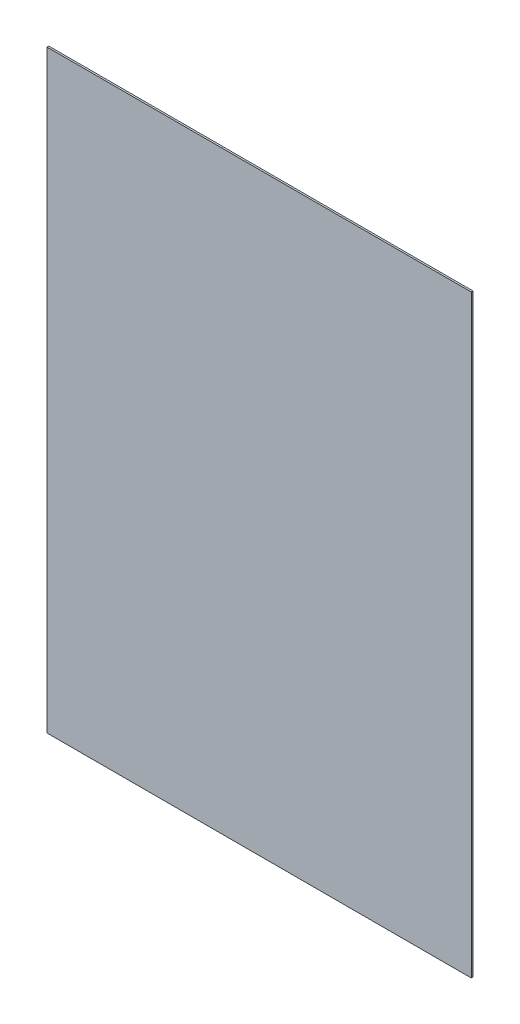
ISO-10303-21;
HEADER;
FILE_DESCRIPTION(('STEP AP214'),'2;1');
FILE_NAME('part.step','',(''),(''),'','','');
FILE_SCHEMA(('AUTOMOTIVE_DESIGN { 1 0 10303 214 1 1 1 1 }'));
ENDSEC;
DATA;
#1=APPLICATION_CONTEXT('core data for automotive mechanical design processes');
#2=APPLICATION_PROTOCOL_DEFINITION('international standard','automotive_design',2000,#1);
#3=PRODUCT_CONTEXT('',#1,'mechanical');
#4=PRODUCT('Part','Part','',(#3));
#5=PRODUCT_RELATED_PRODUCT_CATEGORY('part','',(#4));
#6=PRODUCT_DEFINITION_FORMATION('','',#4);
#7=PRODUCT_DEFINITION_CONTEXT('part definition',#1,'design');
#8=PRODUCT_DEFINITION('design','',#6,#7);
#9=PRODUCT_DEFINITION_SHAPE('','',#8);
#10=(LENGTH_UNIT() NAMED_UNIT(*) SI_UNIT(.MILLI.,.METRE.));
#11=(NAMED_UNIT(*) PLANE_ANGLE_UNIT() SI_UNIT($,.RADIAN.));
#12=(NAMED_UNIT(*) SI_UNIT($,.STERADIAN.) SOLID_ANGLE_UNIT());
#13=UNCERTAINTY_MEASURE_WITH_UNIT(LENGTH_MEASURE(1.E-05),#10,'distance_accuracy_value','');
#14=(GEOMETRIC_REPRESENTATION_CONTEXT(3) GLOBAL_UNCERTAINTY_ASSIGNED_CONTEXT((#13)) GLOBAL_UNIT_ASSIGNED_CONTEXT((#10,
#11,#12)) REPRESENTATION_CONTEXT('',''));
#15=CARTESIAN_POINT('',(0.,0.,0.));
#16=DIRECTION('',(0.,0.,1.));
#17=DIRECTION('',(1.,0.,0.));
#18=AXIS2_PLACEMENT_3D('',#15,#16,#17);
#19=CARTESIAN_POINT('',(381.,533.4,3.175));
#20=DIRECTION('',(-1.,0.,0.));
#21=DIRECTION('',(0.,-1.,0.));
#22=AXIS2_PLACEMENT_3D('',#19,#20,#21);
#23=PLANE('',#22);
#24=DIRECTION('',(0.,1.,0.));
#25=VECTOR('',#24,1.);
#26=CARTESIAN_POINT('',(381.,533.4,0.));
#27=LINE('',#26,#25);
#28=CARTESIAN_POINT('',(381.,-533.4,0.));
#29=VERTEX_POINT('',#28);
#30=CARTESIAN_POINT('',(381.,533.4,0.));
#31=VERTEX_POINT('',#30);
#32=EDGE_CURVE('E99',#29,#31,#27,.T.);
#33=ORIENTED_EDGE('',*,*,#32,.T.);
#34=DIRECTION('',(0.,0.,-1.));
#35=VECTOR('',#34,1.);
#36=CARTESIAN_POINT('',(381.,533.4,3.175));
#37=LINE('',#36,#35);
#38=CARTESIAN_POINT('',(381.,533.4,3.175));
#39=VERTEX_POINT('',#38);
#40=EDGE_CURVE('E11',#39,#31,#37,.T.);
#41=ORIENTED_EDGE('',*,*,#40,.F.);
#42=DIRECTION('',(0.,1.,0.));
#43=VECTOR('',#42,1.);
#44=CARTESIAN_POINT('',(381.,533.4,3.175));
#45=LINE('',#44,#43);
#46=CARTESIAN_POINT('',(381.,-533.4,3.175));
#47=VERTEX_POINT('',#46);
#48=EDGE_CURVE('E87',#47,#39,#45,.T.);
#49=ORIENTED_EDGE('',*,*,#48,.F.);
#50=DIRECTION('',(0.,0.,-1.));
#51=VECTOR('',#50,1.);
#52=CARTESIAN_POINT('',(381.,-533.4,3.175));
#53=LINE('',#52,#51);
#54=EDGE_CURVE('E95',#47,#29,#53,.T.);
#55=ORIENTED_EDGE('',*,*,#54,.T.);
#56=EDGE_LOOP('',(#33,#41,#49,#55));
#57=FACE_BOUND('',#56,.T.);
#58=ADVANCED_FACE('F36',(#57),#23,.F.);
#59=CARTESIAN_POINT('',(-381.,533.4,3.175));
#60=DIRECTION('',(0.,-1.,0.));
#61=DIRECTION('',(0.,0.,-1.));
#62=AXIS2_PLACEMENT_3D('',#59,#60,#61);
#63=PLANE('',#62);
#64=DIRECTION('',(-1.,0.,0.));
#65=VECTOR('',#64,1.);
#66=CARTESIAN_POINT('',(-381.,533.4,0.));
#67=LINE('',#66,#65);
#68=CARTESIAN_POINT('',(-381.,533.4,0.));
#69=VERTEX_POINT('',#68);
#70=EDGE_CURVE('E91',#31,#69,#67,.T.);
#71=ORIENTED_EDGE('',*,*,#70,.T.);
#72=DIRECTION('',(0.,0.,-1.));
#73=VECTOR('',#72,1.);
#74=CARTESIAN_POINT('',(-381.,533.4,3.175));
#75=LINE('',#74,#73);
#76=CARTESIAN_POINT('',(-381.,533.4,3.175));
#77=VERTEX_POINT('',#76);
#78=EDGE_CURVE('E44',#77,#69,#75,.T.);
#79=ORIENTED_EDGE('',*,*,#78,.F.);
#80=DIRECTION('',(-1.,0.,0.));
#81=VECTOR('',#80,1.);
#82=CARTESIAN_POINT('',(-381.,533.4,3.175));
#83=LINE('',#82,#81);
#84=EDGE_CURVE('E82',#39,#77,#83,.T.);
#85=ORIENTED_EDGE('',*,*,#84,.F.);
#86=ORIENTED_EDGE('',*,*,#40,.T.);
#87=EDGE_LOOP('',(#71,#79,#85,#86));
#88=FACE_BOUND('',#87,.T.);
#89=ADVANCED_FACE('F90',(#88),#63,.F.);
#90=CARTESIAN_POINT('',(-381.,533.4,3.175));
#91=DIRECTION('',(1.,0.,0.));
#92=DIRECTION('',(0.,1.,0.));
#93=AXIS2_PLACEMENT_3D('',#90,#91,#92);
#94=PLANE('',#93);
#95=DIRECTION('',(0.,-1.,0.));
#96=VECTOR('',#95,1.);
#97=CARTESIAN_POINT('',(-381.,533.4,0.));
#98=LINE('',#97,#96);
#99=CARTESIAN_POINT('',(-381.,-533.4,0.));
#100=VERTEX_POINT('',#99);
#101=EDGE_CURVE('E69',#69,#100,#98,.T.);
#102=ORIENTED_EDGE('',*,*,#101,.T.);
#103=DIRECTION('',(0.,0.,-1.));
#104=VECTOR('',#103,1.);
#105=CARTESIAN_POINT('',(-381.,-533.4,3.175));
#106=LINE('',#105,#104);
#107=CARTESIAN_POINT('',(-381.,-533.4,3.175));
#108=VERTEX_POINT('',#107);
#109=EDGE_CURVE('E92',#108,#100,#106,.T.);
#110=ORIENTED_EDGE('',*,*,#109,.F.);
#111=DIRECTION('',(0.,-1.,0.));
#112=VECTOR('',#111,1.);
#113=CARTESIAN_POINT('',(-381.,533.4,3.175));
#114=LINE('',#113,#112);
#115=EDGE_CURVE('E85',#77,#108,#114,.T.);
#116=ORIENTED_EDGE('',*,*,#115,.F.);
#117=ORIENTED_EDGE('',*,*,#78,.T.);
#118=EDGE_LOOP('',(#102,#110,#116,#117));
#119=FACE_BOUND('',#118,.T.);
#120=ADVANCED_FACE('F93',(#119),#94,.F.);
#121=CARTESIAN_POINT('',(-381.,-533.4,3.175));
#122=DIRECTION('',(0.,1.,0.));
#123=DIRECTION('',(0.,0.,1.));
#124=AXIS2_PLACEMENT_3D('',#121,#122,#123);
#125=PLANE('',#124);
#126=DIRECTION('',(1.,0.,0.));
#127=VECTOR('',#126,1.);
#128=CARTESIAN_POINT('',(-381.,-533.4,0.));
#129=LINE('',#128,#127);
#130=EDGE_CURVE('E75',#100,#29,#129,.T.);
#131=ORIENTED_EDGE('',*,*,#130,.T.);
#132=ORIENTED_EDGE('',*,*,#54,.F.);
#133=DIRECTION('',(1.,0.,0.));
#134=VECTOR('',#133,1.);
#135=CARTESIAN_POINT('',(-381.,-533.4,3.175));
#136=LINE('',#135,#134);
#137=EDGE_CURVE('E52',#108,#47,#136,.T.);
#138=ORIENTED_EDGE('',*,*,#137,.F.);
#139=ORIENTED_EDGE('',*,*,#109,.T.);
#140=EDGE_LOOP('',(#131,#132,#138,#139));
#141=FACE_BOUND('',#140,.T.);
#142=ADVANCED_FACE('F106',(#141),#125,.F.);
#143=CARTESIAN_POINT('',(0.,0.,3.175));
#144=DIRECTION('',(0.,0.,1.));
#145=DIRECTION('',(1.,0.,0.));
#146=AXIS2_PLACEMENT_3D('',#143,#144,#145);
#147=PLANE('',#146);
#148=ORIENTED_EDGE('',*,*,#48,.T.);
#149=ORIENTED_EDGE('',*,*,#84,.T.);
#150=ORIENTED_EDGE('',*,*,#115,.T.);
#151=ORIENTED_EDGE('',*,*,#137,.T.);
#152=EDGE_LOOP('',(#148,#149,#150,#151));
#153=FACE_BOUND('',#152,.T.);
#154=ADVANCED_FACE('F83',(#153),#147,.T.);
#155=CARTESIAN_POINT('',(0.,0.,0.));
#156=DIRECTION('',(0.,0.,1.));
#157=DIRECTION('',(1.,0.,0.));
#158=AXIS2_PLACEMENT_3D('',#155,#156,#157);
#159=PLANE('',#158);
#160=ORIENTED_EDGE('',*,*,#32,.F.);
#161=ORIENTED_EDGE('',*,*,#130,.F.);
#162=ORIENTED_EDGE('',*,*,#101,.F.);
#163=ORIENTED_EDGE('',*,*,#70,.F.);
#164=EDGE_LOOP('',(#160,#161,#162,#163));
#165=FACE_BOUND('',#164,.T.);
#166=ADVANCED_FACE('F109',(#165),#159,.F.);
#167=CLOSED_SHELL('',(#58,#89,#120,#142,#154,#166));
#168=MANIFOLD_SOLID_BREP('B2',#167);
#169=ADVANCED_BREP_SHAPE_REPRESENTATION('',(#18,#168),#14);
#170=SHAPE_DEFINITION_REPRESENTATION(#9,#169);
ENDSEC;
END-ISO-10303-21;
